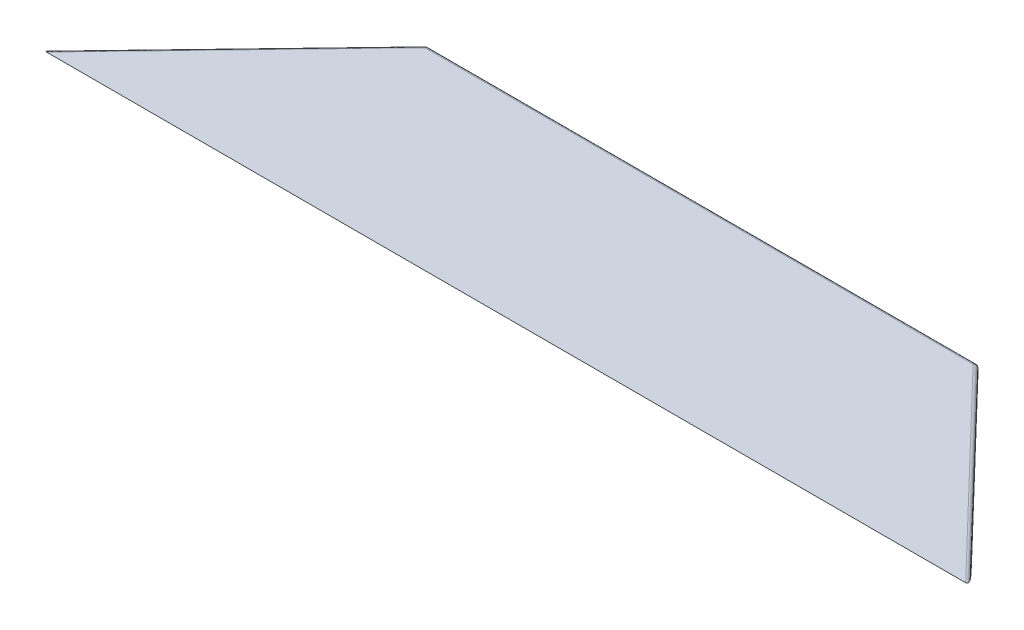
ISO-10303-21;
HEADER;
FILE_DESCRIPTION(('STEP AP214'),'2;1');
FILE_NAME('part.step','',(''),(''),'','','');
FILE_SCHEMA(('AUTOMOTIVE_DESIGN { 1 0 10303 214 1 1 1 1 }'));
ENDSEC;
DATA;
#1=APPLICATION_CONTEXT('core data for automotive mechanical design processes');
#2=APPLICATION_PROTOCOL_DEFINITION('international standard','automotive_design',2000,#1);
#3=PRODUCT_CONTEXT('',#1,'mechanical');
#4=PRODUCT('Part','Part','',(#3));
#5=PRODUCT_RELATED_PRODUCT_CATEGORY('part','',(#4));
#6=PRODUCT_DEFINITION_FORMATION('','',#4);
#7=PRODUCT_DEFINITION_CONTEXT('part definition',#1,'design');
#8=PRODUCT_DEFINITION('design','',#6,#7);
#9=PRODUCT_DEFINITION_SHAPE('','',#8);
#10=(LENGTH_UNIT() NAMED_UNIT(*) SI_UNIT(.MILLI.,.METRE.));
#11=(NAMED_UNIT(*) PLANE_ANGLE_UNIT() SI_UNIT($,.RADIAN.));
#12=(NAMED_UNIT(*) SI_UNIT($,.STERADIAN.) SOLID_ANGLE_UNIT());
#13=UNCERTAINTY_MEASURE_WITH_UNIT(LENGTH_MEASURE(1.E-05),#10,'distance_accuracy_value','');
#14=(GEOMETRIC_REPRESENTATION_CONTEXT(3) GLOBAL_UNCERTAINTY_ASSIGNED_CONTEXT((#13)) GLOBAL_UNIT_ASSIGNED_CONTEXT((#10,
#11,#12)) REPRESENTATION_CONTEXT('',''));
#15=CARTESIAN_POINT('',(0.,0.,0.));
#16=DIRECTION('',(0.,0.,1.));
#17=DIRECTION('',(1.,0.,0.));
#18=AXIS2_PLACEMENT_3D('',#15,#16,#17);
#19=CARTESIAN_POINT('',(680.609534704294,4.5439410523207,-177.8));
#20=DIRECTION('',(0.,-1.,0.));
#21=DIRECTION('',(0.,0.,-1.));
#22=AXIS2_PLACEMENT_3D('',#19,#20,#21);
#23=CYLINDRICAL_SURFACE('',#22,3.175);
#24=DIRECTION('',(0.,1.,0.));
#25=VECTOR('',#24,1.);
#26=CARTESIAN_POINT('',(682.898513704913,0.,-180.000272740949));
#27=LINE('',#26,#25);
#28=CARTESIAN_POINT('',(682.898513704914,0.,-180.000272740947));
#29=VERTEX_POINT('',#28);
#30=CARTESIAN_POINT('',(682.898513704942,3.175,-180.000272740974));
#31=VERTEX_POINT('',#30);
#32=EDGE_CURVE('E169',#29,#31,#27,.T.);
#33=ORIENTED_EDGE('',*,*,#32,.F.);
#34=CARTESIAN_POINT('',(680.609534704294,0.,-177.8));
#35=DIRECTION('',(0.,-1.,0.));
#36=DIRECTION('',(0.,0.,-1.));
#37=AXIS2_PLACEMENT_3D('',#34,#35,#36);
#38=CIRCLE('',#37,3.175);
#39=CARTESIAN_POINT('',(680.609534704294,0.,-180.975));
#40=VERTEX_POINT('',#39);
#41=EDGE_CURVE('E176',#29,#40,#38,.F.);
#42=ORIENTED_EDGE('',*,*,#41,.T.);
#43=DIRECTION('',(0.,1.,0.));
#44=VECTOR('',#43,1.);
#45=CARTESIAN_POINT('',(680.609534704294,0.,-180.975));
#46=LINE('',#45,#44);
#47=CARTESIAN_POINT('',(680.609534704294,3.175,-180.975));
#48=VERTEX_POINT('',#47);
#49=EDGE_CURVE('E168',#48,#40,#46,.F.);
#50=ORIENTED_EDGE('',*,*,#49,.F.);
#51=CARTESIAN_POINT('',(680.609534704294,3.175,-177.8));
#52=DIRECTION('',(0.,-1.,0.));
#53=DIRECTION('',(0.,0.,-1.));
#54=AXIS2_PLACEMENT_3D('',#51,#52,#53);
#55=CIRCLE('',#54,3.175);
#56=EDGE_CURVE('E172',#31,#48,#55,.F.);
#57=ORIENTED_EDGE('',*,*,#56,.F.);
#58=EDGE_LOOP('',(#33,#42,#50,#57));
#59=FACE_BOUND('',#58,.T.);
#60=ADVANCED_FACE('F16',(#59),#23,.T.);
#61=CARTESIAN_POINT('',(175.313586638851,5.19418805217208,-177.8));
#62=DIRECTION('',(0.,-1.,0.));
#63=DIRECTION('',(0.,0.,-1.));
#64=AXIS2_PLACEMENT_3D('',#61,#62,#63);
#65=CYLINDRICAL_SURFACE('',#64,3.175);
#66=DIRECTION('',(0.,1.,0.));
#67=VECTOR('',#66,1.);
#68=CARTESIAN_POINT('',(175.313586638851,0.,-180.975));
#69=LINE('',#68,#67);
#70=CARTESIAN_POINT('',(175.313586638851,0.,-180.975));
#71=VERTEX_POINT('',#70);
#72=CARTESIAN_POINT('',(175.313586625275,3.175,-180.975));
#73=VERTEX_POINT('',#72);
#74=EDGE_CURVE('E189',#71,#73,#69,.T.);
#75=ORIENTED_EDGE('',*,*,#74,.F.);
#76=CARTESIAN_POINT('',(175.313586638851,0.,-177.8));
#77=DIRECTION('',(0.,-1.,0.));
#78=DIRECTION('',(0.,0.,-1.));
#79=AXIS2_PLACEMENT_3D('',#76,#77,#78);
#80=CIRCLE('',#79,3.175);
#81=CARTESIAN_POINT('',(173.02460763823,0.,-180.000272740961));
#82=VERTEX_POINT('',#81);
#83=EDGE_CURVE('E19',#71,#82,#80,.F.);
#84=ORIENTED_EDGE('',*,*,#83,.T.);
#85=DIRECTION('',(0.,1.,0.));
#86=VECTOR('',#85,1.);
#87=CARTESIAN_POINT('',(173.024607638237,0.,-180.000272740969));
#88=LINE('',#87,#86);
#89=CARTESIAN_POINT('',(173.024607638226,3.175,-180.000272740964));
#90=VERTEX_POINT('',#89);
#91=EDGE_CURVE('E141',#90,#82,#88,.F.);
#92=ORIENTED_EDGE('',*,*,#91,.F.);
#93=CARTESIAN_POINT('',(175.313586638851,3.175,-177.8));
#94=DIRECTION('',(0.,-1.,0.));
#95=DIRECTION('',(0.,0.,-1.));
#96=AXIS2_PLACEMENT_3D('',#93,#94,#95);
#97=CIRCLE('',#96,3.175);
#98=EDGE_CURVE('E184',#73,#90,#97,.F.);
#99=ORIENTED_EDGE('',*,*,#98,.F.);
#100=EDGE_LOOP('',(#75,#84,#92,#99));
#101=FACE_BOUND('',#100,.T.);
#102=ADVANCED_FACE('F215',(#101),#65,.T.);
#103=CARTESIAN_POINT('',(0.,0.,0.));
#104=DIRECTION('',(0.,1.,0.));
#105=DIRECTION('',(0.,0.,1.));
#106=AXIS2_PLACEMENT_3D('',#103,#104,#105);
#107=PLANE('',#106);
#108=ORIENTED_EDGE('',*,*,#41,.F.);
#109=DIRECTION('',(-0.692999288492446,0.,-0.720938267918248));
#110=VECTOR('',#109,1.);
#111=CARTESIAN_POINT('',(855.92312134312,0.,0.));
#112=LINE('',#111,#110);
#113=CARTESIAN_POINT('',(834.636242067337,0.,-22.1450817183939));
#114=VERTEX_POINT('',#113);
#115=EDGE_CURVE('E173',#114,#29,#112,.T.);
#116=ORIENTED_EDGE('',*,*,#115,.F.);
#117=DIRECTION('',(1.,0.,0.));
#118=VECTOR('',#117,1.);
#119=CARTESIAN_POINT('',(427.96156067156,0.,-22.1450817183891));
#120=LINE('',#119,#118);
#121=CARTESIAN_POINT('',(21.2868792757619,0.,-22.1450817183876));
#122=VERTEX_POINT('',#121);
#123=EDGE_CURVE('E136',#122,#114,#120,.T.);
#124=ORIENTED_EDGE('',*,*,#123,.F.);
#125=DIRECTION('',(-0.692999288492446,0.,0.720938267918248));
#126=VECTOR('',#125,1.);
#127=CARTESIAN_POINT('',(173.961560671585,0.,-180.975));
#128=LINE('',#127,#126);
#129=EDGE_CURVE('E83',#82,#122,#128,.T.);
#130=ORIENTED_EDGE('',*,*,#129,.F.);
#131=ORIENTED_EDGE('',*,*,#83,.F.);
#132=DIRECTION('',(-1.,0.,0.));
#133=VECTOR('',#132,1.);
#134=CARTESIAN_POINT('',(681.96156067156,0.,-180.975));
#135=LINE('',#134,#133);
#136=EDGE_CURVE('E187',#40,#71,#135,.T.);
#137=ORIENTED_EDGE('',*,*,#136,.F.);
#138=EDGE_LOOP('',(#108,#116,#124,#130,#131,#137));
#139=FACE_BOUND('',#138,.T.);
#140=ADVANCED_FACE('F205',(#139),#107,.F.);
#141=CARTESIAN_POINT('',(855.92312134312,0.,0.));
#142=DIRECTION('',(0.720938267918248,0.,-0.692999288492446));
#143=DIRECTION('',(-0.692999288492446,0.,-0.720938267918248));
#144=AXIS2_PLACEMENT_3D('',#141,#142,#143);
#145=PLANE('',#144);
#146=ORIENTED_EDGE('',*,*,#115,.T.);
#147=ORIENTED_EDGE('',*,*,#32,.T.);
#148=DIRECTION('',(-0.692999288492446,0.,-0.720938267918248));
#149=VECTOR('',#148,1.);
#150=CARTESIAN_POINT('',(1080.58440766328,3.175,233.718737259036));
#151=LINE('',#150,#149);
#152=CARTESIAN_POINT('',(845.279681705302,3.17500000000001,-11.0725408592096));
#153=VERTEX_POINT('',#152);
#154=EDGE_CURVE('E130',#153,#31,#151,.T.);
#155=ORIENTED_EDGE('',*,*,#154,.F.);
#156=DIRECTION('',(0.678649766535716,0.202445175813225,0.706010230216936));
#157=VECTOR('',#156,1.);
#158=CARTESIAN_POINT('',(834.636242067332,0.,-22.1450817183891));
#159=LINE('',#158,#157);
#160=EDGE_CURVE('E134',#114,#153,#159,.T.);
#161=ORIENTED_EDGE('',*,*,#160,.F.);
#162=EDGE_LOOP('',(#146,#147,#155,#161));
#163=FACE_BOUND('',#162,.T.);
#164=ADVANCED_FACE('F164',(#163),#145,.T.);
#165=CARTESIAN_POINT('',(680.609534704294,3.175,-177.8));
#166=DIRECTION('',(8.43015025958807E-08,0.7071067772943,-0.70710678507879));
#167=DIRECTION('',(-0.999999999999993,2.12594329150094E-11,-1.191990682106E-07));
#168=AXIS2_PLACEMENT_3D('',#165,#166,#167);
#169=SPHERICAL_SURFACE('',#168,3.175);
#170=CARTESIAN_POINT('',(680.609534704294,3.175,-177.8));
#171=DIRECTION('',(-1.,0.,0.));
#172=DIRECTION('',(0.,0.,1.));
#173=AXIS2_PLACEMENT_3D('',#170,#171,#172);
#174=CIRCLE('',#173,3.175);
#175=CARTESIAN_POINT('',(680.609534704294,5.42006401790944,-180.045064042625));
#176=VERTEX_POINT('',#175);
#177=EDGE_CURVE('E34',#176,#48,#174,.T.);
#178=ORIENTED_EDGE('',*,*,#177,.F.);
#179=CARTESIAN_POINT('',(680.609534704294,3.175,-177.8));
#180=DIRECTION('',(-1.,0.,0.));
#181=DIRECTION('',(0.,0.,1.));
#182=AXIS2_PLACEMENT_3D('',#179,#180,#181);
#183=CIRCLE('',#182,3.175);
#184=CARTESIAN_POINT('',(680.609534704294,6.35,-177.800000000003));
#185=VERTEX_POINT('',#184);
#186=EDGE_CURVE('E128',#185,#176,#183,.T.);
#187=ORIENTED_EDGE('',*,*,#186,.F.);
#188=CARTESIAN_POINT('',(680.609534704328,3.175,-177.800000000038));
#189=DIRECTION('',(-0.692999288492446,0.,-0.720938267918248));
#190=DIRECTION('',(-0.720938267918248,0.,0.692999288492446));
#191=AXIS2_PLACEMENT_3D('',#188,#189,#190);
#192=CIRCLE('',#191,3.175);
#193=EDGE_CURVE('E133',#31,#185,#192,.F.);
#194=ORIENTED_EDGE('',*,*,#193,.F.);
#195=ORIENTED_EDGE('',*,*,#56,.T.);
#196=EDGE_LOOP('',(#178,#187,#194,#195));
#197=FACE_BOUND('',#196,.T.);
#198=ADVANCED_FACE('F159',(#197),#169,.T.);
#199=CARTESIAN_POINT('',(681.96156067156,0.,-180.975));
#200=DIRECTION('',(0.,0.,-1.));
#201=DIRECTION('',(-1.,0.,0.));
#202=AXIS2_PLACEMENT_3D('',#199,#200,#201);
#203=PLANE('',#202);
#204=ORIENTED_EDGE('',*,*,#136,.T.);
#205=ORIENTED_EDGE('',*,*,#74,.T.);
#206=DIRECTION('',(-1.,0.,0.));
#207=VECTOR('',#206,1.);
#208=CARTESIAN_POINT('',(1971.70450232606,3.175,-180.975));
#209=LINE('',#208,#207);
#210=EDGE_CURVE('E127',#48,#73,#209,.T.);
#211=ORIENTED_EDGE('',*,*,#210,.F.);
#212=ORIENTED_EDGE('',*,*,#49,.T.);
#213=EDGE_LOOP('',(#204,#205,#211,#212));
#214=FACE_BOUND('',#213,.T.);
#215=ADVANCED_FACE('F154',(#214),#203,.T.);
#216=CARTESIAN_POINT('',(175.313586638851,3.175,-177.8));
#217=DIRECTION('',(-2.41982548755813E-08,0.70710667614974,-0.707106886223339));
#218=DIRECTION('',(-0.999999999999999,-1.14823680111034E-11,3.42100127827948E-08));
#219=AXIS2_PLACEMENT_3D('',#216,#217,#218);
#220=SPHERICAL_SURFACE('',#219,3.175);
#221=CARTESIAN_POINT('',(175.313586611699,3.175,-177.8));
#222=DIRECTION('',(-1.,0.,0.));
#223=DIRECTION('',(0.,0.,1.));
#224=AXIS2_PLACEMENT_3D('',#221,#222,#223);
#225=CIRCLE('',#224,3.175);
#226=CARTESIAN_POINT('',(175.313586611699,5.42006369677543,-180.045064363759));
#227=VERTEX_POINT('',#226);
#228=CARTESIAN_POINT('',(175.313586625275,6.35,-177.80000001305));
#229=VERTEX_POINT('',#228);
#230=EDGE_CURVE('E126',#227,#229,#225,.F.);
#231=ORIENTED_EDGE('',*,*,#230,.F.);
#232=CARTESIAN_POINT('',(175.313586611699,3.175,-177.8));
#233=DIRECTION('',(-1.,0.,0.));
#234=DIRECTION('',(0.,0.,1.));
#235=AXIS2_PLACEMENT_3D('',#232,#233,#234);
#236=CIRCLE('',#235,3.175);
#237=EDGE_CURVE('E123',#73,#227,#236,.F.);
#238=ORIENTED_EDGE('',*,*,#237,.F.);
#239=ORIENTED_EDGE('',*,*,#98,.T.);
#240=CARTESIAN_POINT('',(175.313586638861,3.175,-177.799999999991));
#241=DIRECTION('',(0.692999288492446,0.,-0.720938267918248));
#242=DIRECTION('',(-0.720938267918248,0.,-0.692999288492446));
#243=AXIS2_PLACEMENT_3D('',#240,#241,#242);
#244=CIRCLE('',#243,3.175);
#245=EDGE_CURVE('E191',#229,#90,#244,.F.);
#246=ORIENTED_EDGE('',*,*,#245,.F.);
#247=EDGE_LOOP('',(#231,#238,#239,#246));
#248=FACE_BOUND('',#247,.T.);
#249=ADVANCED_FACE('F149',(#248),#220,.T.);
#250=CARTESIAN_POINT('',(173.961560671585,0.,-180.975));
#251=DIRECTION('',(-0.720938267918248,0.,-0.692999288492446));
#252=DIRECTION('',(-0.692999288492446,0.,0.720938267918248));
#253=AXIS2_PLACEMENT_3D('',#250,#251,#252);
#254=PLANE('',#253);
#255=DIRECTION('',(0.692999288492446,0.,-0.720938267918248));
#256=VECTOR('',#255,1.);
#257=CARTESIAN_POINT('',(-225.144822642977,3.175,234.221767846395));
#258=LINE('',#257,#256);
#259=CARTESIAN_POINT('',(10.6434396378852,3.175,-11.0725408591937));
#260=VERTEX_POINT('',#259);
#261=EDGE_CURVE('E113',#90,#260,#258,.F.);
#262=ORIENTED_EDGE('',*,*,#261,.F.);
#263=ORIENTED_EDGE('',*,*,#91,.T.);
#264=ORIENTED_EDGE('',*,*,#129,.T.);
#265=DIRECTION('',(0.678649766535195,-0.202445175813357,-0.706010230217399));
#266=VECTOR('',#265,1.);
#267=CARTESIAN_POINT('',(10.6434396378813,3.175,-11.0725408591945));
#268=LINE('',#267,#266);
#269=EDGE_CURVE('E139',#260,#122,#268,.T.);
#270=ORIENTED_EDGE('',*,*,#269,.F.);
#271=EDGE_LOOP('',(#262,#263,#264,#270));
#272=FACE_BOUND('',#271,.T.);
#273=ADVANCED_FACE('F153',(#272),#254,.T.);
#274=CARTESIAN_POINT('',(427.96156067156,3.175,-11.0725408591945));
#275=DIRECTION('',(0.,-0.961261695938317,0.275637355817005));
#276=DIRECTION('',(0.,-0.275637355817005,-0.961261695938317));
#277=AXIS2_PLACEMENT_3D('',#274,#275,#276);
#278=PLANE('',#277);
#279=DIRECTION('',(1.,0.,0.));
#280=VECTOR('',#279,1.);
#281=CARTESIAN_POINT('',(0.,6.35,0.));
#282=LINE('',#281,#280);
#283=CARTESIAN_POINT('',(4.40398317205544,6.35,1.17093834628434E-13));
#284=VERTEX_POINT('',#283);
#285=CARTESIAN_POINT('',(851.519138171173,6.35,0.));
#286=VERTEX_POINT('',#285);
#287=EDGE_CURVE('E93',#284,#286,#282,.T.);
#288=ORIENTED_EDGE('',*,*,#287,.F.);
#289=CARTESIAN_POINT('',(15.0474228099391,3.175,-11.0725408591945));
#290=DIRECTION('',(0.,-0.961261695938317,0.275637355817005));
#291=DIRECTION('',(0.707101141902446,-0.194906597831496,-0.679720084477433));
#292=AXIS2_PLACEMENT_3D('',#289,#290,#291);
#293=ELLIPSE('',#292,15.9774539956602,3.175);
#294=EDGE_CURVE('E97',#260,#284,#293,.F.);
#295=ORIENTED_EDGE('',*,*,#294,.F.);
#296=ORIENTED_EDGE('',*,*,#269,.T.);
#297=ORIENTED_EDGE('',*,*,#123,.T.);
#298=ORIENTED_EDGE('',*,*,#160,.T.);
#299=CARTESIAN_POINT('',(840.875698533295,3.175,-11.0725408591945));
#300=DIRECTION('',(0.,-0.961261695938317,0.275637355817005));
#301=DIRECTION('',(-0.707101141902446,-0.194906597831496,-0.679720084477433));
#302=AXIS2_PLACEMENT_3D('',#299,#300,#301);
#303=ELLIPSE('',#302,15.9774539956602,3.175);
#304=EDGE_CURVE('E101',#286,#153,#303,.F.);
#305=ORIENTED_EDGE('',*,*,#304,.F.);
#306=EDGE_LOOP('',(#288,#295,#296,#297,#298,#305));
#307=FACE_BOUND('',#306,.T.);
#308=ADVANCED_FACE('F95',(#307),#278,.T.);
#309=CARTESIAN_POINT('',(1078.29542866264,3.175,235.91901));
#310=DIRECTION('',(-0.692999288492446,0.,-0.720938267918248));
#311=DIRECTION('',(-0.720938267918248,0.,0.692999288492446));
#312=AXIS2_PLACEMENT_3D('',#309,#310,#311);
#313=CYLINDRICAL_SURFACE('',#312,3.175);
#314=DIRECTION('',(-0.692999288492584,0.,-0.720938267918115));
#315=VECTOR('',#314,1.);
#316=CARTESIAN_POINT('',(851.51913817117,6.35,0.));
#317=LINE('',#316,#315);
#318=EDGE_CURVE('E105',#286,#185,#317,.T.);
#319=ORIENTED_EDGE('',*,*,#318,.F.);
#320=ORIENTED_EDGE('',*,*,#304,.T.);
#321=ORIENTED_EDGE('',*,*,#154,.T.);
#322=ORIENTED_EDGE('',*,*,#193,.T.);
#323=EDGE_LOOP('',(#319,#320,#321,#322));
#324=FACE_BOUND('',#323,.T.);
#325=ADVANCED_FACE('F212',(#324),#313,.T.);
#326=CARTESIAN_POINT('',(1971.70450232606,3.175,-177.8));
#327=DIRECTION('',(-1.,0.,0.));
#328=DIRECTION('',(0.,0.,1.));
#329=AXIS2_PLACEMENT_3D('',#326,#327,#328);
#330=CYLINDRICAL_SURFACE('',#329,3.175);
#331=ORIENTED_EDGE('',*,*,#210,.T.);
#332=ORIENTED_EDGE('',*,*,#237,.T.);
#333=ORIENTED_EDGE('',*,*,#230,.T.);
#334=DIRECTION('',(1.,0.,0.));
#335=VECTOR('',#334,1.);
#336=CARTESIAN_POINT('',(0.,6.35,-177.8));
#337=LINE('',#336,#335);
#338=EDGE_CURVE('E25',#185,#229,#337,.F.);
#339=ORIENTED_EDGE('',*,*,#338,.F.);
#340=ORIENTED_EDGE('',*,*,#186,.T.);
#341=ORIENTED_EDGE('',*,*,#177,.T.);
#342=EDGE_LOOP('',(#331,#332,#333,#339,#340,#341));
#343=FACE_BOUND('',#342,.T.);
#344=ADVANCED_FACE('F209',(#343),#330,.T.);
#345=CARTESIAN_POINT('',(-222.855843642336,3.175,236.422040587358));
#346=DIRECTION('',(0.692999288492446,0.,-0.720938267918248));
#347=DIRECTION('',(-0.720938267918248,0.,-0.692999288492446));
#348=AXIS2_PLACEMENT_3D('',#345,#346,#347);
#349=CYLINDRICAL_SURFACE('',#348,3.175);
#350=ORIENTED_EDGE('',*,*,#261,.T.);
#351=ORIENTED_EDGE('',*,*,#294,.T.);
#352=DIRECTION('',(-0.692999288492424,0.,0.72093826791827));
#353=VECTOR('',#352,1.);
#354=CARTESIAN_POINT('',(175.313586638851,6.35,-177.8));
#355=LINE('',#354,#353);
#356=EDGE_CURVE('E11',#229,#284,#355,.T.);
#357=ORIENTED_EDGE('',*,*,#356,.F.);
#358=ORIENTED_EDGE('',*,*,#245,.T.);
#359=EDGE_LOOP('',(#350,#351,#357,#358));
#360=FACE_BOUND('',#359,.T.);
#361=ADVANCED_FACE('F109',(#360),#349,.T.);
#362=CARTESIAN_POINT('',(0.,6.35,0.));
#363=DIRECTION('',(0.,1.,0.));
#364=DIRECTION('',(0.,0.,1.));
#365=AXIS2_PLACEMENT_3D('',#362,#363,#364);
#366=PLANE('',#365);
#367=ORIENTED_EDGE('',*,*,#338,.T.);
#368=ORIENTED_EDGE('',*,*,#356,.T.);
#369=ORIENTED_EDGE('',*,*,#287,.T.);
#370=ORIENTED_EDGE('',*,*,#318,.T.);
#371=EDGE_LOOP('',(#367,#368,#369,#370));
#372=FACE_BOUND('',#371,.T.);
#373=ADVANCED_FACE('F115',(#372),#366,.T.);
#374=CLOSED_SHELL('',(#60,#102,#140,#164,#198,#215,#249,#273,#308,#325,#344,#361,#373));
#375=MANIFOLD_SOLID_BREP('B1',#374);
#376=ADVANCED_BREP_SHAPE_REPRESENTATION('',(#18,#375),#14);
#377=SHAPE_DEFINITION_REPRESENTATION(#9,#376);
ENDSEC;
END-ISO-10303-21;
